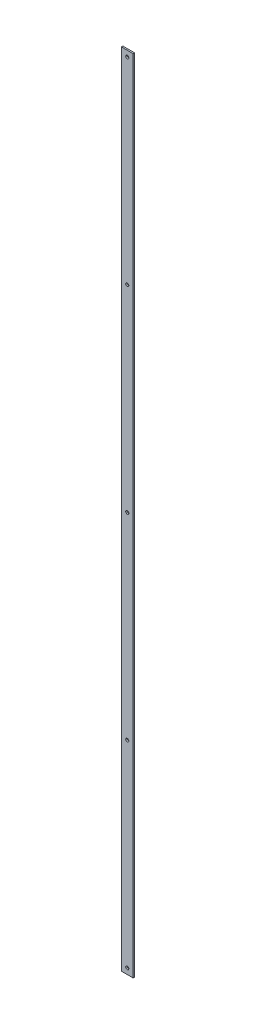
ISO-10303-21;
HEADER;
FILE_DESCRIPTION(('STEP AP214'),'2;1');
FILE_NAME('part.step','',(''),(''),'','','');
FILE_SCHEMA(('AUTOMOTIVE_DESIGN { 1 0 10303 214 1 1 1 1 }'));
ENDSEC;
DATA;
#1=APPLICATION_CONTEXT('core data for automotive mechanical design processes');
#2=APPLICATION_PROTOCOL_DEFINITION('international standard','automotive_design',2000,#1);
#3=PRODUCT_CONTEXT('',#1,'mechanical');
#4=PRODUCT('Part','Part','',(#3));
#5=PRODUCT_RELATED_PRODUCT_CATEGORY('part','',(#4));
#6=PRODUCT_DEFINITION_FORMATION('','',#4);
#7=PRODUCT_DEFINITION_CONTEXT('part definition',#1,'design');
#8=PRODUCT_DEFINITION('design','',#6,#7);
#9=PRODUCT_DEFINITION_SHAPE('','',#8);
#10=(LENGTH_UNIT() NAMED_UNIT(*) SI_UNIT(.MILLI.,.METRE.));
#11=(NAMED_UNIT(*) PLANE_ANGLE_UNIT() SI_UNIT($,.RADIAN.));
#12=(NAMED_UNIT(*) SI_UNIT($,.STERADIAN.) SOLID_ANGLE_UNIT());
#13=UNCERTAINTY_MEASURE_WITH_UNIT(LENGTH_MEASURE(1.E-05),#10,'distance_accuracy_value','');
#14=(GEOMETRIC_REPRESENTATION_CONTEXT(3) GLOBAL_UNCERTAINTY_ASSIGNED_CONTEXT((#13)) GLOBAL_UNIT_ASSIGNED_CONTEXT((#10,
#11,#12)) REPRESENTATION_CONTEXT('',''));
#15=CARTESIAN_POINT('',(0.,0.,0.));
#16=DIRECTION('',(0.,0.,1.));
#17=DIRECTION('',(1.,0.,0.));
#18=AXIS2_PLACEMENT_3D('',#15,#16,#17);
#19=CARTESIAN_POINT('',(12.7,1714.5,0.));
#20=DIRECTION('',(0.,0.,1.));
#21=DIRECTION('',(1.,0.,0.));
#22=AXIS2_PLACEMENT_3D('',#19,#20,#21);
#23=CYLINDRICAL_SURFACE('',#22,3.3655);
#24=CARTESIAN_POINT('',(12.7,1714.5,0.));
#25=DIRECTION('',(0.,0.,1.));
#26=DIRECTION('',(1.,0.,0.));
#27=AXIS2_PLACEMENT_3D('',#24,#25,#26);
#28=CIRCLE('',#27,3.3655);
#29=CARTESIAN_POINT('',(16.0655,1714.5,0.));
#30=VERTEX_POINT('',#29);
#31=EDGE_CURVE('E45',#30,#30,#28,.T.);
#32=ORIENTED_EDGE('',*,*,#31,.F.);
#33=EDGE_LOOP('',(#32));
#34=FACE_BOUND('',#33,.T.);
#35=CARTESIAN_POINT('',(12.7,1714.5,3.175));
#36=DIRECTION('',(0.,0.,1.));
#37=DIRECTION('',(1.,0.,0.));
#38=AXIS2_PLACEMENT_3D('',#35,#36,#37);
#39=CIRCLE('',#38,3.3655);
#40=CARTESIAN_POINT('',(16.0655,1714.5,3.175));
#41=VERTEX_POINT('',#40);
#42=EDGE_CURVE('E11',#41,#41,#39,.T.);
#43=ORIENTED_EDGE('',*,*,#42,.T.);
#44=EDGE_LOOP('',(#43));
#45=FACE_BOUND('',#44,.T.);
#46=ADVANCED_FACE('F37',(#34,#45),#23,.F.);
#47=CARTESIAN_POINT('',(12.7,1289.05,0.));
#48=DIRECTION('',(0.,0.,1.));
#49=DIRECTION('',(1.,0.,0.));
#50=AXIS2_PLACEMENT_3D('',#47,#48,#49);
#51=CYLINDRICAL_SURFACE('',#50,3.3655);
#52=CARTESIAN_POINT('',(12.7,1289.05,0.));
#53=DIRECTION('',(0.,0.,1.));
#54=DIRECTION('',(1.,0.,0.));
#55=AXIS2_PLACEMENT_3D('',#52,#53,#54);
#56=CIRCLE('',#55,3.3655);
#57=CARTESIAN_POINT('',(16.0655,1289.05,0.));
#58=VERTEX_POINT('',#57);
#59=EDGE_CURVE('E121',#58,#58,#56,.T.);
#60=ORIENTED_EDGE('',*,*,#59,.F.);
#61=EDGE_LOOP('',(#60));
#62=FACE_BOUND('',#61,.T.);
#63=CARTESIAN_POINT('',(12.7,1289.05,3.175));
#64=DIRECTION('',(0.,0.,1.));
#65=DIRECTION('',(1.,0.,0.));
#66=AXIS2_PLACEMENT_3D('',#63,#64,#65);
#67=CIRCLE('',#66,3.3655);
#68=CARTESIAN_POINT('',(16.0655,1289.05,3.175));
#69=VERTEX_POINT('',#68);
#70=EDGE_CURVE('E124',#69,#69,#67,.T.);
#71=ORIENTED_EDGE('',*,*,#70,.T.);
#72=EDGE_LOOP('',(#71));
#73=FACE_BOUND('',#72,.T.);
#74=ADVANCED_FACE('F133',(#62,#73),#51,.F.);
#75=CARTESIAN_POINT('',(12.7,863.6,0.));
#76=DIRECTION('',(0.,0.,1.));
#77=DIRECTION('',(1.,0.,0.));
#78=AXIS2_PLACEMENT_3D('',#75,#76,#77);
#79=CYLINDRICAL_SURFACE('',#78,3.3655);
#80=CARTESIAN_POINT('',(12.7,863.6,0.));
#81=DIRECTION('',(0.,0.,1.));
#82=DIRECTION('',(1.,0.,0.));
#83=AXIS2_PLACEMENT_3D('',#80,#81,#82);
#84=CIRCLE('',#83,3.3655);
#85=CARTESIAN_POINT('',(16.0655,863.6,0.));
#86=VERTEX_POINT('',#85);
#87=EDGE_CURVE('E115',#86,#86,#84,.T.);
#88=ORIENTED_EDGE('',*,*,#87,.F.);
#89=EDGE_LOOP('',(#88));
#90=FACE_BOUND('',#89,.T.);
#91=CARTESIAN_POINT('',(12.7,863.6,3.175));
#92=DIRECTION('',(0.,0.,1.));
#93=DIRECTION('',(1.,0.,0.));
#94=AXIS2_PLACEMENT_3D('',#91,#92,#93);
#95=CIRCLE('',#94,3.3655);
#96=CARTESIAN_POINT('',(16.0655,863.6,3.175));
#97=VERTEX_POINT('',#96);
#98=EDGE_CURVE('E118',#97,#97,#95,.T.);
#99=ORIENTED_EDGE('',*,*,#98,.T.);
#100=EDGE_LOOP('',(#99));
#101=FACE_BOUND('',#100,.T.);
#102=ADVANCED_FACE('F160',(#90,#101),#79,.F.);
#103=CARTESIAN_POINT('',(0.,1727.2,3.175));
#104=DIRECTION('',(1.,0.,0.));
#105=DIRECTION('',(0.,1.,0.));
#106=AXIS2_PLACEMENT_3D('',#103,#104,#105);
#107=PLANE('',#106);
#108=DIRECTION('',(0.,-1.,0.));
#109=VECTOR('',#108,1.);
#110=CARTESIAN_POINT('',(0.,1727.2,0.));
#111=LINE('',#110,#109);
#112=CARTESIAN_POINT('',(0.,1727.2,0.));
#113=VERTEX_POINT('',#112);
#114=CARTESIAN_POINT('',(0.,0.,0.));
#115=VERTEX_POINT('',#114);
#116=EDGE_CURVE('E105',#113,#115,#111,.T.);
#117=ORIENTED_EDGE('',*,*,#116,.T.);
#118=DIRECTION('',(0.,0.,-1.));
#119=VECTOR('',#118,1.);
#120=CARTESIAN_POINT('',(0.,0.,3.175));
#121=LINE('',#120,#119);
#122=CARTESIAN_POINT('',(0.,0.,3.175));
#123=VERTEX_POINT('',#122);
#124=EDGE_CURVE('E96',#123,#115,#121,.T.);
#125=ORIENTED_EDGE('',*,*,#124,.F.);
#126=DIRECTION('',(0.,-1.,0.));
#127=VECTOR('',#126,1.);
#128=CARTESIAN_POINT('',(0.,1727.2,3.175));
#129=LINE('',#128,#127);
#130=CARTESIAN_POINT('',(0.,1727.2,3.175));
#131=VERTEX_POINT('',#130);
#132=EDGE_CURVE('E90',#131,#123,#129,.T.);
#133=ORIENTED_EDGE('',*,*,#132,.F.);
#134=DIRECTION('',(0.,0.,-1.));
#135=VECTOR('',#134,1.);
#136=CARTESIAN_POINT('',(0.,1727.2,3.175));
#137=LINE('',#136,#135);
#138=EDGE_CURVE('E101',#131,#113,#137,.T.);
#139=ORIENTED_EDGE('',*,*,#138,.T.);
#140=EDGE_LOOP('',(#117,#125,#133,#139));
#141=FACE_BOUND('',#140,.T.);
#142=ADVANCED_FACE('F157',(#141),#107,.F.);
#143=CARTESIAN_POINT('',(0.,0.,3.175));
#144=DIRECTION('',(0.,1.,0.));
#145=DIRECTION('',(0.,0.,1.));
#146=AXIS2_PLACEMENT_3D('',#143,#144,#145);
#147=PLANE('',#146);
#148=DIRECTION('',(1.,0.,0.));
#149=VECTOR('',#148,1.);
#150=CARTESIAN_POINT('',(0.,0.,0.));
#151=LINE('',#150,#149);
#152=CARTESIAN_POINT('',(25.4,0.,0.));
#153=VERTEX_POINT('',#152);
#154=EDGE_CURVE('E95',#115,#153,#151,.T.);
#155=ORIENTED_EDGE('',*,*,#154,.T.);
#156=DIRECTION('',(0.,0.,-1.));
#157=VECTOR('',#156,1.);
#158=CARTESIAN_POINT('',(25.4,0.,3.175));
#159=LINE('',#158,#157);
#160=CARTESIAN_POINT('',(25.4,0.,3.175));
#161=VERTEX_POINT('',#160);
#162=EDGE_CURVE('E93',#161,#153,#159,.T.);
#163=ORIENTED_EDGE('',*,*,#162,.F.);
#164=DIRECTION('',(1.,0.,0.));
#165=VECTOR('',#164,1.);
#166=CARTESIAN_POINT('',(0.,0.,3.175));
#167=LINE('',#166,#165);
#168=EDGE_CURVE('E84',#123,#161,#167,.T.);
#169=ORIENTED_EDGE('',*,*,#168,.F.);
#170=ORIENTED_EDGE('',*,*,#124,.T.);
#171=EDGE_LOOP('',(#155,#163,#169,#170));
#172=FACE_BOUND('',#171,.T.);
#173=ADVANCED_FACE('F94',(#172),#147,.F.);
#174=CARTESIAN_POINT('',(25.4,0.,3.175));
#175=DIRECTION('',(-1.,0.,0.));
#176=DIRECTION('',(0.,0.,1.));
#177=AXIS2_PLACEMENT_3D('',#174,#175,#176);
#178=PLANE('',#177);
#179=DIRECTION('',(0.,1.,0.));
#180=VECTOR('',#179,1.);
#181=CARTESIAN_POINT('',(25.4,0.,0.));
#182=LINE('',#181,#180);
#183=CARTESIAN_POINT('',(25.4,1727.2,0.));
#184=VERTEX_POINT('',#183);
#185=EDGE_CURVE('E70',#153,#184,#182,.T.);
#186=ORIENTED_EDGE('',*,*,#185,.T.);
#187=DIRECTION('',(0.,0.,-1.));
#188=VECTOR('',#187,1.);
#189=CARTESIAN_POINT('',(25.4,1727.2,3.175));
#190=LINE('',#189,#188);
#191=CARTESIAN_POINT('',(25.4,1727.2,3.175));
#192=VERTEX_POINT('',#191);
#193=EDGE_CURVE('E97',#192,#184,#190,.T.);
#194=ORIENTED_EDGE('',*,*,#193,.F.);
#195=DIRECTION('',(0.,1.,0.));
#196=VECTOR('',#195,1.);
#197=CARTESIAN_POINT('',(25.4,0.,3.175));
#198=LINE('',#197,#196);
#199=EDGE_CURVE('E88',#161,#192,#198,.T.);
#200=ORIENTED_EDGE('',*,*,#199,.F.);
#201=ORIENTED_EDGE('',*,*,#162,.T.);
#202=EDGE_LOOP('',(#186,#194,#200,#201));
#203=FACE_BOUND('',#202,.T.);
#204=ADVANCED_FACE('F99',(#203),#178,.F.);
#205=CARTESIAN_POINT('',(0.,1727.2,3.175));
#206=DIRECTION('',(0.,-1.,0.));
#207=DIRECTION('',(0.,0.,-1.));
#208=AXIS2_PLACEMENT_3D('',#205,#206,#207);
#209=PLANE('',#208);
#210=DIRECTION('',(-1.,0.,0.));
#211=VECTOR('',#210,1.);
#212=CARTESIAN_POINT('',(0.,1727.2,0.));
#213=LINE('',#212,#211);
#214=EDGE_CURVE('E76',#184,#113,#213,.T.);
#215=ORIENTED_EDGE('',*,*,#214,.T.);
#216=ORIENTED_EDGE('',*,*,#138,.F.);
#217=DIRECTION('',(-1.,0.,0.));
#218=VECTOR('',#217,1.);
#219=CARTESIAN_POINT('',(0.,1727.2,3.175));
#220=LINE('',#219,#218);
#221=EDGE_CURVE('E53',#192,#131,#220,.T.);
#222=ORIENTED_EDGE('',*,*,#221,.F.);
#223=ORIENTED_EDGE('',*,*,#193,.T.);
#224=EDGE_LOOP('',(#215,#216,#222,#223));
#225=FACE_BOUND('',#224,.T.);
#226=ADVANCED_FACE('F137',(#225),#209,.F.);
#227=CARTESIAN_POINT('',(0.,0.,3.175));
#228=DIRECTION('',(0.,0.,1.));
#229=DIRECTION('',(1.,0.,0.));
#230=AXIS2_PLACEMENT_3D('',#227,#228,#229);
#231=PLANE('',#230);
#232=CARTESIAN_POINT('',(12.7,438.15,3.175));
#233=DIRECTION('',(0.,0.,1.));
#234=DIRECTION('',(1.,0.,0.));
#235=AXIS2_PLACEMENT_3D('',#232,#233,#234);
#236=CIRCLE('',#235,3.3655);
#237=CARTESIAN_POINT('',(16.0655,438.15,3.175));
#238=VERTEX_POINT('',#237);
#239=EDGE_CURVE('E239',#238,#238,#236,.T.);
#240=ORIENTED_EDGE('',*,*,#239,.F.);
#241=EDGE_LOOP('',(#240));
#242=FACE_BOUND('',#241,.T.);
#243=CARTESIAN_POINT('',(12.7,12.7,3.175));
#244=DIRECTION('',(0.,0.,1.));
#245=DIRECTION('',(1.,0.,0.));
#246=AXIS2_PLACEMENT_3D('',#243,#244,#245);
#247=CIRCLE('',#246,3.3655);
#248=CARTESIAN_POINT('',(16.0655,12.7,3.175));
#249=VERTEX_POINT('',#248);
#250=EDGE_CURVE('E240',#249,#249,#247,.T.);
#251=ORIENTED_EDGE('',*,*,#250,.F.);
#252=EDGE_LOOP('',(#251));
#253=FACE_BOUND('',#252,.T.);
#254=ORIENTED_EDGE('',*,*,#132,.T.);
#255=ORIENTED_EDGE('',*,*,#168,.T.);
#256=ORIENTED_EDGE('',*,*,#199,.T.);
#257=ORIENTED_EDGE('',*,*,#221,.T.);
#258=EDGE_LOOP('',(#254,#255,#256,#257));
#259=FACE_BOUND('',#258,.T.);
#260=ORIENTED_EDGE('',*,*,#98,.F.);
#261=EDGE_LOOP('',(#260));
#262=FACE_BOUND('',#261,.T.);
#263=ORIENTED_EDGE('',*,*,#70,.F.);
#264=EDGE_LOOP('',(#263));
#265=FACE_BOUND('',#264,.T.);
#266=ORIENTED_EDGE('',*,*,#42,.F.);
#267=EDGE_LOOP('',(#266));
#268=FACE_BOUND('',#267,.T.);
#269=ADVANCED_FACE('F85',(#242,#253,#259,#262,#265,#268),#231,.T.);
#270=CARTESIAN_POINT('',(0.,0.,0.));
#271=DIRECTION('',(0.,0.,1.));
#272=DIRECTION('',(1.,0.,0.));
#273=AXIS2_PLACEMENT_3D('',#270,#271,#272);
#274=PLANE('',#273);
#275=CARTESIAN_POINT('',(12.7,438.15,0.));
#276=DIRECTION('',(0.,0.,1.));
#277=DIRECTION('',(1.,0.,0.));
#278=AXIS2_PLACEMENT_3D('',#275,#276,#277);
#279=CIRCLE('',#278,3.3655);
#280=CARTESIAN_POINT('',(16.0655,438.15,0.));
#281=VERTEX_POINT('',#280);
#282=EDGE_CURVE('E237',#281,#281,#279,.T.);
#283=ORIENTED_EDGE('',*,*,#282,.T.);
#284=EDGE_LOOP('',(#283));
#285=FACE_BOUND('',#284,.T.);
#286=CARTESIAN_POINT('',(12.7,12.7,0.));
#287=DIRECTION('',(0.,0.,1.));
#288=DIRECTION('',(1.,0.,0.));
#289=AXIS2_PLACEMENT_3D('',#286,#287,#288);
#290=CIRCLE('',#289,3.3655);
#291=CARTESIAN_POINT('',(16.0655,12.7,0.));
#292=VERTEX_POINT('',#291);
#293=EDGE_CURVE('E108',#292,#292,#290,.T.);
#294=ORIENTED_EDGE('',*,*,#293,.T.);
#295=EDGE_LOOP('',(#294));
#296=FACE_BOUND('',#295,.T.);
#297=ORIENTED_EDGE('',*,*,#116,.F.);
#298=ORIENTED_EDGE('',*,*,#214,.F.);
#299=ORIENTED_EDGE('',*,*,#185,.F.);
#300=ORIENTED_EDGE('',*,*,#154,.F.);
#301=EDGE_LOOP('',(#297,#298,#299,#300));
#302=FACE_BOUND('',#301,.T.);
#303=ORIENTED_EDGE('',*,*,#87,.T.);
#304=EDGE_LOOP('',(#303));
#305=FACE_BOUND('',#304,.T.);
#306=ORIENTED_EDGE('',*,*,#59,.T.);
#307=EDGE_LOOP('',(#306));
#308=FACE_BOUND('',#307,.T.);
#309=ORIENTED_EDGE('',*,*,#31,.T.);
#310=EDGE_LOOP('',(#309));
#311=FACE_BOUND('',#310,.T.);
#312=ADVANCED_FACE('F129',(#285,#296,#302,#305,#308,#311),#274,.F.);
#313=CARTESIAN_POINT('',(12.7,12.7,0.));
#314=DIRECTION('',(0.,0.,1.));
#315=DIRECTION('',(1.,0.,0.));
#316=AXIS2_PLACEMENT_3D('',#313,#314,#315);
#317=CYLINDRICAL_SURFACE('',#316,3.3655);
#318=ORIENTED_EDGE('',*,*,#293,.F.);
#319=EDGE_LOOP('',(#318));
#320=FACE_BOUND('',#319,.T.);
#321=ORIENTED_EDGE('',*,*,#250,.T.);
#322=EDGE_LOOP('',(#321));
#323=FACE_BOUND('',#322,.T.);
#324=ADVANCED_FACE('F144',(#320,#323),#317,.F.);
#325=CARTESIAN_POINT('',(12.7,438.15,0.));
#326=DIRECTION('',(0.,0.,1.));
#327=DIRECTION('',(1.,0.,0.));
#328=AXIS2_PLACEMENT_3D('',#325,#326,#327);
#329=CYLINDRICAL_SURFACE('',#328,3.3655);
#330=ORIENTED_EDGE('',*,*,#282,.F.);
#331=EDGE_LOOP('',(#330));
#332=FACE_BOUND('',#331,.T.);
#333=ORIENTED_EDGE('',*,*,#239,.T.);
#334=EDGE_LOOP('',(#333));
#335=FACE_BOUND('',#334,.T.);
#336=ADVANCED_FACE('F204',(#332,#335),#329,.F.);
#337=CLOSED_SHELL('',(#46,#74,#102,#142,#173,#204,#226,#269,#312,#324,#336));
#338=MANIFOLD_SOLID_BREP('B2',#337);
#339=ADVANCED_BREP_SHAPE_REPRESENTATION('',(#18,#338),#14);
#340=SHAPE_DEFINITION_REPRESENTATION(#9,#339);
ENDSEC;
END-ISO-10303-21;
